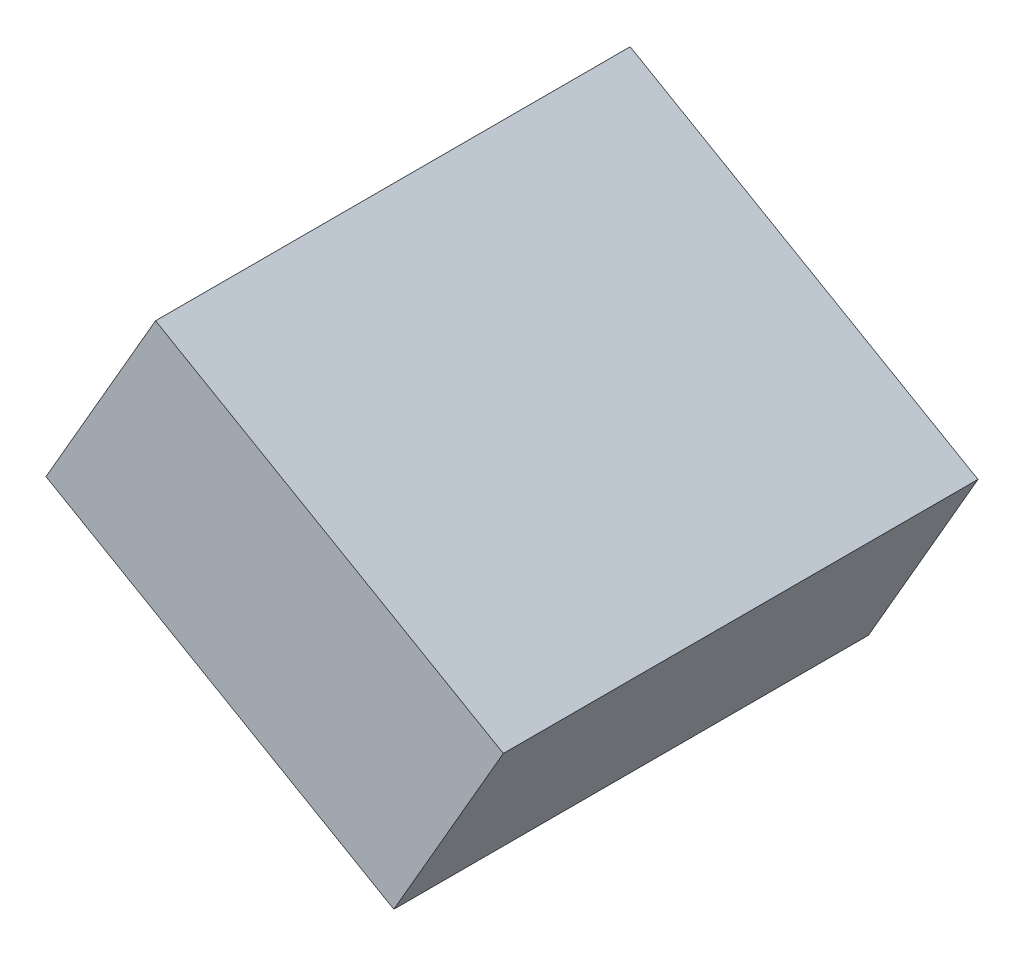
ISO-10303-21;
HEADER;
FILE_DESCRIPTION(('STEP AP214'),'2;1');
FILE_NAME('part.step','',(''),(''),'','','');
FILE_SCHEMA(('AUTOMOTIVE_DESIGN { 1 0 10303 214 1 1 1 1 }'));
ENDSEC;
DATA;
#1=APPLICATION_CONTEXT('core data for automotive mechanical design processes');
#2=APPLICATION_PROTOCOL_DEFINITION('international standard','automotive_design',2000,#1);
#3=PRODUCT_CONTEXT('',#1,'mechanical');
#4=PRODUCT('Part','Part','',(#3));
#5=PRODUCT_RELATED_PRODUCT_CATEGORY('part','',(#4));
#6=PRODUCT_DEFINITION_FORMATION('','',#4);
#7=PRODUCT_DEFINITION_CONTEXT('part definition',#1,'design');
#8=PRODUCT_DEFINITION('design','',#6,#7);
#9=PRODUCT_DEFINITION_SHAPE('','',#8);
#10=(LENGTH_UNIT() NAMED_UNIT(*) SI_UNIT(.MILLI.,.METRE.));
#11=(NAMED_UNIT(*) PLANE_ANGLE_UNIT() SI_UNIT($,.RADIAN.));
#12=(NAMED_UNIT(*) SI_UNIT($,.STERADIAN.) SOLID_ANGLE_UNIT());
#13=UNCERTAINTY_MEASURE_WITH_UNIT(LENGTH_MEASURE(1.E-05),#10,'distance_accuracy_value','');
#14=(GEOMETRIC_REPRESENTATION_CONTEXT(3) GLOBAL_UNCERTAINTY_ASSIGNED_CONTEXT((#13)) GLOBAL_UNIT_ASSIGNED_CONTEXT((#10,
#11,#12)) REPRESENTATION_CONTEXT('',''));
#15=CARTESIAN_POINT('',(0.,0.,0.));
#16=DIRECTION('',(0.,0.,1.));
#17=DIRECTION('',(1.,0.,0.));
#18=AXIS2_PLACEMENT_3D('',#15,#16,#17);
#19=CARTESIAN_POINT('',(-0.6263132,0.01519428,0.));
#20=DIRECTION('',(0.499999621666995,0.866025622214991,0.));
#21=DIRECTION('',(-0.866025622214991,0.499999621666995,0.));
#22=AXIS2_PLACEMENT_3D('',#19,#20,#21);
#23=PLANE('',#22);
#24=DIRECTION('',(0.,0.,1.));
#25=VECTOR('',#24,1.);
#26=CARTESIAN_POINT('',(0.3263138,-0.53480462,0.));
#27=LINE('',#26,#25);
#28=CARTESIAN_POINT('',(0.326313800000037,-0.534804619999936,0.));
#29=VERTEX_POINT('',#28);
#30=CARTESIAN_POINT('',(0.326313800000037,-0.534804619999936,1.29999994));
#31=VERTEX_POINT('',#30);
#32=EDGE_CURVE('E19',#29,#31,#27,.T.);
#33=ORIENTED_EDGE('',*,*,#32,.T.);
#34=DIRECTION('',(-0.866025622214856,0.499999621667228,0.));
#35=VECTOR('',#34,1.);
#36=CARTESIAN_POINT('',(0.3263138,-0.53480462,1.29999994));
#37=LINE('',#36,#35);
#38=CARTESIAN_POINT('',(-0.626313199999952,0.0151942799999725,1.29999994));
#39=VERTEX_POINT('',#38);
#40=EDGE_CURVE('E54',#31,#39,#37,.T.);
#41=ORIENTED_EDGE('',*,*,#40,.T.);
#42=DIRECTION('',(0.,0.,1.));
#43=VECTOR('',#42,1.);
#44=CARTESIAN_POINT('',(-0.626313199999809,0.0151942799998898,0.));
#45=LINE('',#44,#43);
#46=CARTESIAN_POINT('',(-0.626313199999952,0.0151942799999724,0.));
#47=VERTEX_POINT('',#46);
#48=EDGE_CURVE('E75',#39,#47,#45,.F.);
#49=ORIENTED_EDGE('',*,*,#48,.T.);
#50=DIRECTION('',(-0.866025622214856,0.499999621667228,0.));
#51=VECTOR('',#50,1.);
#52=CARTESIAN_POINT('',(0.3263138,-0.53480462,0.));
#53=LINE('',#52,#51);
#54=EDGE_CURVE('E57',#29,#47,#53,.T.);
#55=ORIENTED_EDGE('',*,*,#54,.F.);
#56=EDGE_LOOP('',(#33,#41,#49,#55));
#57=FACE_BOUND('',#56,.T.);
#58=ADVANCED_FACE('F16',(#57),#23,.F.);
#59=CARTESIAN_POINT('',(0.3263138,-0.53480462,0.));
#60=DIRECTION('',(-0.866023794167606,0.500002787927772,0.));
#61=DIRECTION('',(-0.500002787927772,-0.866023794167606,0.));
#62=AXIS2_PLACEMENT_3D('',#59,#60,#61);
#63=PLANE('',#62);
#64=DIRECTION('',(0.,0.,1.));
#65=VECTOR('',#64,1.);
#66=CARTESIAN_POINT('',(0.6263132,-0.01519428,0.));
#67=LINE('',#66,#65);
#68=CARTESIAN_POINT('',(0.62631320000004,-0.015194280000023,0.));
#69=VERTEX_POINT('',#68);
#70=CARTESIAN_POINT('',(0.62631320000004,-0.015194280000023,1.29999994));
#71=VERTEX_POINT('',#70);
#72=EDGE_CURVE('E72',#69,#71,#67,.T.);
#73=ORIENTED_EDGE('',*,*,#72,.T.);
#74=DIRECTION('',(-0.500002787927639,-0.866023794167683,0.));
#75=VECTOR('',#74,1.);
#76=CARTESIAN_POINT('',(0.6263132,-0.01519428,1.29999994));
#77=LINE('',#76,#75);
#78=EDGE_CURVE('E62',#71,#31,#77,.T.);
#79=ORIENTED_EDGE('',*,*,#78,.T.);
#80=ORIENTED_EDGE('',*,*,#32,.F.);
#81=DIRECTION('',(-0.500002787927639,-0.866023794167683,0.));
#82=VECTOR('',#81,1.);
#83=CARTESIAN_POINT('',(0.6263132,-0.01519428,0.));
#84=LINE('',#83,#82);
#85=EDGE_CURVE('E77',#69,#29,#84,.T.);
#86=ORIENTED_EDGE('',*,*,#85,.F.);
#87=EDGE_LOOP('',(#73,#79,#80,#86));
#88=FACE_BOUND('',#87,.T.);
#89=ADVANCED_FACE('F71',(#88),#63,.F.);
#90=CARTESIAN_POINT('',(0.6263132,-0.01519428,1.29999994));
#91=DIRECTION('',(0.,0.,-1.));
#92=DIRECTION('',(-1.,0.,0.));
#93=AXIS2_PLACEMENT_3D('',#90,#91,#92);
#94=PLANE('',#93);
#95=DIRECTION('',(0.500000954825115,0.8660248525152,0.));
#96=VECTOR('',#95,1.);
#97=CARTESIAN_POINT('',(-0.3263138,0.53480716,1.29999994));
#98=LINE('',#97,#96);
#99=CARTESIAN_POINT('',(-0.326313800000063,0.534807159999892,1.29999994));
#100=VERTEX_POINT('',#99);
#101=EDGE_CURVE('E68',#100,#39,#98,.F.);
#102=ORIENTED_EDGE('',*,*,#101,.T.);
#103=ORIENTED_EDGE('',*,*,#40,.F.);
#104=ORIENTED_EDGE('',*,*,#78,.F.);
#105=DIRECTION('',(0.866024622348075,-0.500001353485043,0.));
#106=VECTOR('',#105,1.);
#107=CARTESIAN_POINT('',(0.6263132,-0.01519428,1.29999994));
#108=LINE('',#107,#106);
#109=EDGE_CURVE('E82',#71,#100,#108,.F.);
#110=ORIENTED_EDGE('',*,*,#109,.T.);
#111=EDGE_LOOP('',(#102,#103,#104,#110));
#112=FACE_BOUND('',#111,.T.);
#113=ADVANCED_FACE('F65',(#112),#94,.F.);
#114=CARTESIAN_POINT('',(-0.3263138,0.53480716,0.));
#115=DIRECTION('',(0.8660248525152,-0.500000954825115,0.));
#116=DIRECTION('',(0.500000954825115,0.8660248525152,0.));
#117=AXIS2_PLACEMENT_3D('',#114,#115,#116);
#118=PLANE('',#117);
#119=ORIENTED_EDGE('',*,*,#48,.F.);
#120=ORIENTED_EDGE('',*,*,#101,.F.);
#121=DIRECTION('',(0.,0.,1.));
#122=VECTOR('',#121,1.);
#123=CARTESIAN_POINT('',(-0.326313800000251,0.534807159999566,0.));
#124=LINE('',#123,#122);
#125=CARTESIAN_POINT('',(-0.326313800000063,0.534807159999892,0.));
#126=VERTEX_POINT('',#125);
#127=EDGE_CURVE('E25',#100,#126,#124,.F.);
#128=ORIENTED_EDGE('',*,*,#127,.T.);
#129=DIRECTION('',(0.500000954825433,0.866024852515016,0.));
#130=VECTOR('',#129,1.);
#131=CARTESIAN_POINT('',(-0.6263132,0.01519428,0.));
#132=LINE('',#131,#130);
#133=EDGE_CURVE('E33',#47,#126,#132,.T.);
#134=ORIENTED_EDGE('',*,*,#133,.F.);
#135=EDGE_LOOP('',(#119,#120,#128,#134));
#136=FACE_BOUND('',#135,.T.);
#137=ADVANCED_FACE('F87',(#136),#118,.F.);
#138=CARTESIAN_POINT('',(0.6263132,-0.01519428,0.));
#139=DIRECTION('',(0.,0.,-1.));
#140=DIRECTION('',(-1.,0.,0.));
#141=AXIS2_PLACEMENT_3D('',#138,#139,#140);
#142=PLANE('',#141);
#143=ORIENTED_EDGE('',*,*,#133,.T.);
#144=DIRECTION('',(0.866024622348075,-0.500001353485043,0.));
#145=VECTOR('',#144,1.);
#146=CARTESIAN_POINT('',(0.6263132,-0.01519428,0.));
#147=LINE('',#146,#145);
#148=EDGE_CURVE('E11',#126,#69,#147,.T.);
#149=ORIENTED_EDGE('',*,*,#148,.T.);
#150=ORIENTED_EDGE('',*,*,#85,.T.);
#151=ORIENTED_EDGE('',*,*,#54,.T.);
#152=EDGE_LOOP('',(#143,#149,#150,#151));
#153=FACE_BOUND('',#152,.T.);
#154=ADVANCED_FACE('F90',(#153),#142,.T.);
#155=CARTESIAN_POINT('',(0.6263132,-0.01519428,0.));
#156=DIRECTION('',(-0.500001353485043,-0.866024622348075,0.));
#157=DIRECTION('',(0.866024622348075,-0.500001353485043,0.));
#158=AXIS2_PLACEMENT_3D('',#155,#156,#157);
#159=PLANE('',#158);
#160=ORIENTED_EDGE('',*,*,#127,.F.);
#161=ORIENTED_EDGE('',*,*,#109,.F.);
#162=ORIENTED_EDGE('',*,*,#72,.F.);
#163=ORIENTED_EDGE('',*,*,#148,.F.);
#164=EDGE_LOOP('',(#160,#161,#162,#163));
#165=FACE_BOUND('',#164,.T.);
#166=ADVANCED_FACE('F89',(#165),#159,.F.);
#167=CLOSED_SHELL('',(#58,#89,#113,#137,#154,#166));
#168=MANIFOLD_SOLID_BREP('B1',#167);
#169=ADVANCED_BREP_SHAPE_REPRESENTATION('',(#18,#168),#14);
#170=SHAPE_DEFINITION_REPRESENTATION(#9,#169);
ENDSEC;
END-ISO-10303-21;
